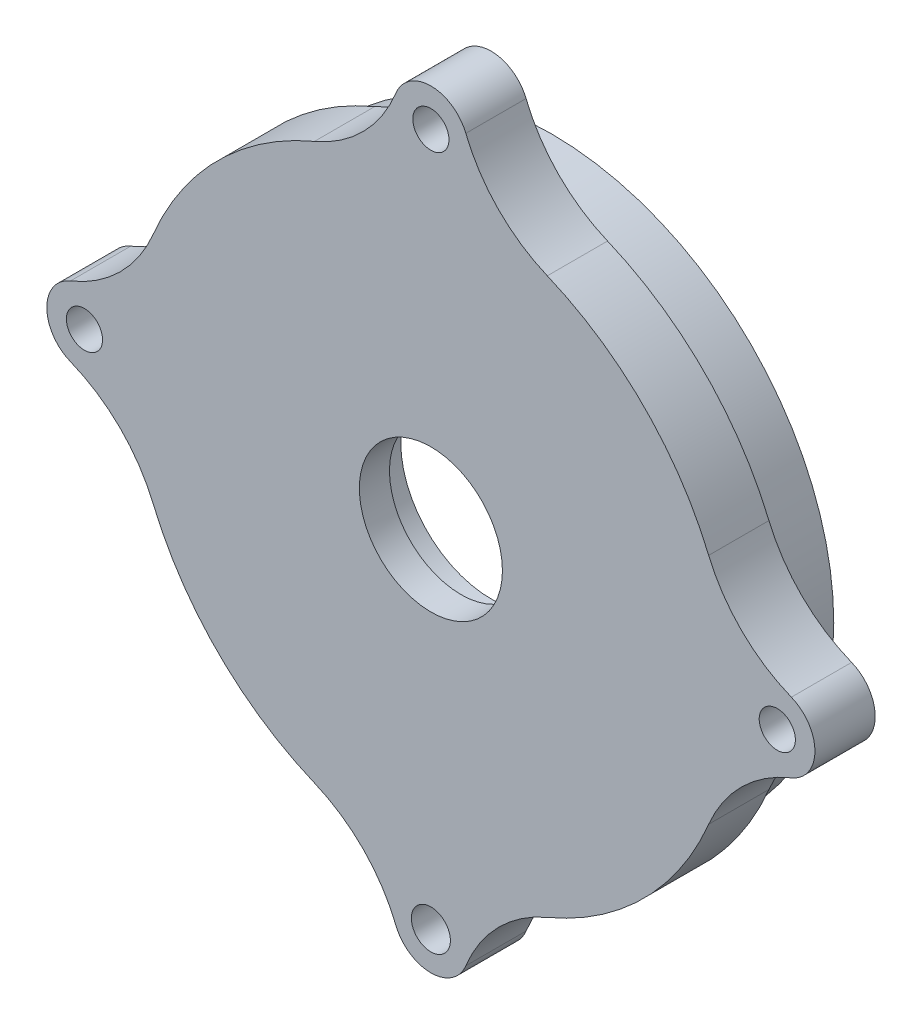
ISO-10303-21;
HEADER;
FILE_DESCRIPTION(('STEP AP214'),'2;1');
FILE_NAME('part.step','',(''),(''),'','','');
FILE_SCHEMA(('AUTOMOTIVE_DESIGN { 1 0 10303 214 1 1 1 1 }'));
ENDSEC;
DATA;
#1=APPLICATION_CONTEXT('core data for automotive mechanical design processes');
#2=APPLICATION_PROTOCOL_DEFINITION('international standard','automotive_design',2000,#1);
#3=PRODUCT_CONTEXT('',#1,'mechanical');
#4=PRODUCT('Part','Part','',(#3));
#5=PRODUCT_RELATED_PRODUCT_CATEGORY('part','',(#4));
#6=PRODUCT_DEFINITION_FORMATION('','',#4);
#7=PRODUCT_DEFINITION_CONTEXT('part definition',#1,'design');
#8=PRODUCT_DEFINITION('design','',#6,#7);
#9=PRODUCT_DEFINITION_SHAPE('','',#8);
#10=(LENGTH_UNIT() NAMED_UNIT(*) SI_UNIT(.MILLI.,.METRE.));
#11=(NAMED_UNIT(*) PLANE_ANGLE_UNIT() SI_UNIT($,.RADIAN.));
#12=(NAMED_UNIT(*) SI_UNIT($,.STERADIAN.) SOLID_ANGLE_UNIT());
#13=UNCERTAINTY_MEASURE_WITH_UNIT(LENGTH_MEASURE(1.E-05),#10,'distance_accuracy_value','');
#14=(GEOMETRIC_REPRESENTATION_CONTEXT(3) GLOBAL_UNCERTAINTY_ASSIGNED_CONTEXT((#13)) GLOBAL_UNIT_ASSIGNED_CONTEXT((#10,
#11,#12)) REPRESENTATION_CONTEXT('',''));
#15=CARTESIAN_POINT('',(0.,0.,0.));
#16=DIRECTION('',(0.,0.,1.));
#17=DIRECTION('',(1.,0.,0.));
#18=AXIS2_PLACEMENT_3D('',#15,#16,#17);
#19=CARTESIAN_POINT('',(0.,0.,4.));
#20=DIRECTION('',(0.,0.,-1.));
#21=DIRECTION('',(-1.,0.,0.));
#22=AXIS2_PLACEMENT_3D('',#19,#20,#21);
#23=CYLINDRICAL_SURFACE('',#22,20.);
#24=DIRECTION('',(0.,0.,1.));
#25=VECTOR('',#24,1.);
#26=CARTESIAN_POINT('',(-7.73032443556006,18.445652173913,0.));
#27=LINE('',#26,#25);
#28=CARTESIAN_POINT('',(-7.73032443556006,18.445652173913,0.));
#29=VERTEX_POINT('',#28);
#30=CARTESIAN_POINT('',(-7.73032443556006,18.445652173913,4.));
#31=VERTEX_POINT('',#30);
#32=EDGE_CURVE('E188',#29,#31,#27,.T.);
#33=ORIENTED_EDGE('',*,*,#32,.F.);
#34=CARTESIAN_POINT('',(0.,0.,0.));
#35=DIRECTION('',(0.,0.,1.));
#36=DIRECTION('',(1.,0.,0.));
#37=AXIS2_PLACEMENT_3D('',#34,#35,#36);
#38=CIRCLE('',#37,20.);
#39=CARTESIAN_POINT('',(-18.4456521739118,7.73032443556295,0.));
#40=VERTEX_POINT('',#39);
#41=EDGE_CURVE('E316',#29,#40,#38,.T.);
#42=ORIENTED_EDGE('',*,*,#41,.T.);
#43=DIRECTION('',(0.,0.,1.));
#44=VECTOR('',#43,1.);
#45=CARTESIAN_POINT('',(-18.4456521739118,7.73032443556295,0.));
#46=LINE('',#45,#44);
#47=CARTESIAN_POINT('',(-18.4456521739118,7.73032443556295,4.));
#48=VERTEX_POINT('',#47);
#49=EDGE_CURVE('E248',#40,#48,#46,.T.);
#50=ORIENTED_EDGE('',*,*,#49,.T.);
#51=CARTESIAN_POINT('',(0.,0.,4.));
#52=DIRECTION('',(0.,0.,1.));
#53=DIRECTION('',(1.,0.,0.));
#54=AXIS2_PLACEMENT_3D('',#51,#52,#53);
#55=CIRCLE('',#54,20.);
#56=EDGE_CURVE('E52',#31,#48,#55,.T.);
#57=ORIENTED_EDGE('',*,*,#56,.F.);
#58=EDGE_LOOP('',(#33,#42,#50,#57));
#59=FACE_BOUND('',#58,.T.);
#60=ADVANCED_FACE('F37',(#59),#23,.T.);
#61=CARTESIAN_POINT('',(18.4456521739143,7.73032443555696,0.));
#62=VERTEX_POINT('',#61);
#63=CARTESIAN_POINT('',(7.73032443556005,18.4456521739131,0.));
#64=VERTEX_POINT('',#63);
#65=EDGE_CURVE('E315',#62,#64,#38,.T.);
#66=ORIENTED_EDGE('',*,*,#65,.T.);
#67=DIRECTION('',(0.,0.,1.));
#68=VECTOR('',#67,1.);
#69=CARTESIAN_POINT('',(7.73032443556005,18.445652173913,0.));
#70=LINE('',#69,#68);
#71=CARTESIAN_POINT('',(7.73032443556005,18.4456521739131,4.));
#72=VERTEX_POINT('',#71);
#73=EDGE_CURVE('E60',#64,#72,#70,.T.);
#74=ORIENTED_EDGE('',*,*,#73,.T.);
#75=CARTESIAN_POINT('',(18.4456521739143,7.73032443555695,4.));
#76=VERTEX_POINT('',#75);
#77=EDGE_CURVE('E312',#76,#72,#55,.T.);
#78=ORIENTED_EDGE('',*,*,#77,.F.);
#79=DIRECTION('',(0.,0.,1.));
#80=VECTOR('',#79,1.);
#81=CARTESIAN_POINT('',(18.4456521739143,7.73032443555696,0.));
#82=LINE('',#81,#80);
#83=EDGE_CURVE('E218',#62,#76,#82,.T.);
#84=ORIENTED_EDGE('',*,*,#83,.F.);
#85=EDGE_LOOP('',(#66,#74,#78,#84));
#86=FACE_BOUND('',#85,.T.);
#87=ADVANCED_FACE('F359',(#86),#23,.T.);
#88=DIRECTION('',(0.,0.,1.));
#89=VECTOR('',#88,1.);
#90=CARTESIAN_POINT('',(-18.4456521739135,-7.73032443555903,0.));
#91=LINE('',#90,#89);
#92=CARTESIAN_POINT('',(-18.4456521739135,-7.73032443555903,0.));
#93=VERTEX_POINT('',#92);
#94=CARTESIAN_POINT('',(-18.4456521739135,-7.73032443555904,4.));
#95=VERTEX_POINT('',#94);
#96=EDGE_CURVE('E251',#93,#95,#91,.T.);
#97=ORIENTED_EDGE('',*,*,#96,.F.);
#98=CARTESIAN_POINT('',(-7.73032443556448,-18.4456521739112,0.));
#99=VERTEX_POINT('',#98);
#100=EDGE_CURVE('E306',#93,#99,#38,.T.);
#101=ORIENTED_EDGE('',*,*,#100,.T.);
#102=DIRECTION('',(0.,0.,1.));
#103=VECTOR('',#102,1.);
#104=CARTESIAN_POINT('',(-7.73032443556448,-18.4456521739112,0.));
#105=LINE('',#104,#103);
#106=CARTESIAN_POINT('',(-7.73032443556448,-18.4456521739112,4.));
#107=VERTEX_POINT('',#106);
#108=EDGE_CURVE('E281',#99,#107,#105,.T.);
#109=ORIENTED_EDGE('',*,*,#108,.T.);
#110=EDGE_CURVE('E313',#95,#107,#55,.T.);
#111=ORIENTED_EDGE('',*,*,#110,.F.);
#112=EDGE_LOOP('',(#97,#101,#109,#111));
#113=FACE_BOUND('',#112,.T.);
#114=ADVANCED_FACE('F338',(#113),#23,.T.);
#115=CARTESIAN_POINT('',(0.,0.,0.));
#116=DIRECTION('',(0.,0.,1.));
#117=DIRECTION('',(1.,0.,0.));
#118=AXIS2_PLACEMENT_3D('',#115,#116,#117);
#119=PLANE('',#118);
#120=CARTESIAN_POINT('',(0.,0.,0.));
#121=DIRECTION('',(0.,0.,-1.));
#122=DIRECTION('',(-1.,0.,0.));
#123=AXIS2_PLACEMENT_3D('',#120,#121,#122);
#124=CIRCLE('',#123,6.);
#125=CARTESIAN_POINT('',(-6.,0.,0.));
#126=VERTEX_POINT('',#125);
#127=EDGE_CURVE('E307',#126,#126,#124,.T.);
#128=ORIENTED_EDGE('',*,*,#127,.F.);
#129=EDGE_LOOP('',(#128));
#130=FACE_BOUND('',#129,.T.);
#131=CARTESIAN_POINT('',(0.,0.,0.));
#132=DIRECTION('',(0.,0.,-1.));
#133=DIRECTION('',(-1.,0.,0.));
#134=AXIS2_PLACEMENT_3D('',#131,#132,#133);
#135=CIRCLE('',#134,17.5);
#136=CARTESIAN_POINT('',(-17.5,0.,0.));
#137=VERTEX_POINT('',#136);
#138=EDGE_CURVE('E284',#137,#137,#135,.T.);
#139=ORIENTED_EDGE('',*,*,#138,.T.);
#140=EDGE_LOOP('',(#139));
#141=FACE_BOUND('',#140,.T.);
#142=ADVANCED_FACE('F335',(#130,#141),#119,.F.);
#143=CARTESIAN_POINT('',(7.73032443555594,-18.4456521739148,0.));
#144=VERTEX_POINT('',#143);
#145=CARTESIAN_POINT('',(18.4456521739124,-7.7303244355616,0.));
#146=VERTEX_POINT('',#145);
#147=EDGE_CURVE('E314',#144,#146,#38,.T.);
#148=ORIENTED_EDGE('',*,*,#147,.T.);
#149=DIRECTION('',(0.,0.,1.));
#150=VECTOR('',#149,1.);
#151=CARTESIAN_POINT('',(18.4456521739124,-7.7303244355616,0.));
#152=LINE('',#151,#150);
#153=CARTESIAN_POINT('',(18.4456521739124,-7.7303244355616,4.));
#154=VERTEX_POINT('',#153);
#155=EDGE_CURVE('E215',#146,#154,#152,.T.);
#156=ORIENTED_EDGE('',*,*,#155,.T.);
#157=CARTESIAN_POINT('',(7.73032443555593,-18.4456521739148,4.));
#158=VERTEX_POINT('',#157);
#159=EDGE_CURVE('E45',#158,#154,#55,.T.);
#160=ORIENTED_EDGE('',*,*,#159,.F.);
#161=DIRECTION('',(0.,0.,1.));
#162=VECTOR('',#161,1.);
#163=CARTESIAN_POINT('',(7.73032443555594,-18.4456521739148,0.));
#164=LINE('',#163,#162);
#165=EDGE_CURVE('E285',#144,#158,#164,.T.);
#166=ORIENTED_EDGE('',*,*,#165,.F.);
#167=EDGE_LOOP('',(#148,#156,#160,#166));
#168=FACE_BOUND('',#167,.T.);
#169=ADVANCED_FACE('F39',(#168),#23,.T.);
#170=CARTESIAN_POINT('',(0.,0.,4.));
#171=DIRECTION('',(0.,0.,1.));
#172=DIRECTION('',(1.,0.,0.));
#173=AXIS2_PLACEMENT_3D('',#170,#171,#172);
#174=PLANE('',#173);
#175=CARTESIAN_POINT('',(0.,0.,4.));
#176=DIRECTION('',(0.,0.,1.));
#177=DIRECTION('',(1.,0.,0.));
#178=AXIS2_PLACEMENT_3D('',#175,#176,#177);
#179=CIRCLE('',#178,4.75);
#180=CARTESIAN_POINT('',(4.75,0.,4.));
#181=VERTEX_POINT('',#180);
#182=EDGE_CURVE('E299',#181,#181,#179,.T.);
#183=ORIENTED_EDGE('',*,*,#182,.F.);
#184=EDGE_LOOP('',(#183));
#185=FACE_BOUND('',#184,.T.);
#186=ORIENTED_EDGE('',*,*,#159,.T.);
#187=CARTESIAN_POINT('',(27.6684782608686,-11.5954866533424,4.));
#188=DIRECTION('',(0.,0.,-1.));
#189=DIRECTION('',(1.,0.,0.));
#190=AXIS2_PLACEMENT_3D('',#187,#188,#189);
#191=CIRCLE('',#190,10.);
#192=CARTESIAN_POINT('',(23.9336956521718,-2.31909733067079,4.));
#193=VERTEX_POINT('',#192);
#194=EDGE_CURVE('E194',#154,#193,#191,.T.);
#195=ORIENTED_EDGE('',*,*,#194,.T.);
#196=CARTESIAN_POINT('',(22.9999999999976,-2.88657986402541E-12,4.));
#197=DIRECTION('',(0.,0.,1.));
#198=DIRECTION('',(1.,0.,0.));
#199=AXIS2_PLACEMENT_3D('',#196,#197,#198);
#200=CIRCLE('',#199,2.5);
#201=CARTESIAN_POINT('',(23.9336956521724,2.31909733066478,4.));
#202=VERTEX_POINT('',#201);
#203=EDGE_CURVE('E210',#193,#202,#200,.T.);
#204=ORIENTED_EDGE('',*,*,#203,.T.);
#205=CARTESIAN_POINT('',(27.6684782608715,11.5954866533354,4.));
#206=DIRECTION('',(0.,0.,-1.));
#207=DIRECTION('',(1.,0.,0.));
#208=AXIS2_PLACEMENT_3D('',#205,#206,#207);
#209=CIRCLE('',#208,9.99999999999999);
#210=EDGE_CURVE('E201',#202,#76,#209,.T.);
#211=ORIENTED_EDGE('',*,*,#210,.T.);
#212=ORIENTED_EDGE('',*,*,#77,.T.);
#213=CARTESIAN_POINT('',(11.5954866533401,27.6684782608696,4.));
#214=DIRECTION('',(0.,0.,-1.));
#215=DIRECTION('',(1.,0.,0.));
#216=AXIS2_PLACEMENT_3D('',#213,#214,#215);
#217=CIRCLE('',#216,10.);
#218=CARTESIAN_POINT('',(2.31909733066801,23.9336956521739,4.));
#219=VERTEX_POINT('',#218);
#220=EDGE_CURVE('E182',#72,#219,#217,.T.);
#221=ORIENTED_EDGE('',*,*,#220,.T.);
#222=CARTESIAN_POINT('',(0.,23.,4.));
#223=DIRECTION('',(0.,0.,1.));
#224=DIRECTION('',(1.,0.,0.));
#225=AXIS2_PLACEMENT_3D('',#222,#223,#224);
#226=CIRCLE('',#225,2.49999999999999);
#227=CARTESIAN_POINT('',(-2.31909733066801,23.9336956521739,4.));
#228=VERTEX_POINT('',#227);
#229=EDGE_CURVE('E156',#219,#228,#226,.T.);
#230=ORIENTED_EDGE('',*,*,#229,.T.);
#231=CARTESIAN_POINT('',(-11.5954866533401,27.6684782608696,4.));
#232=DIRECTION('',(0.,0.,-1.));
#233=DIRECTION('',(1.,0.,0.));
#234=AXIS2_PLACEMENT_3D('',#231,#232,#233);
#235=CIRCLE('',#234,10.);
#236=EDGE_CURVE('E173',#228,#31,#235,.T.);
#237=ORIENTED_EDGE('',*,*,#236,.T.);
#238=ORIENTED_EDGE('',*,*,#56,.T.);
#239=CARTESIAN_POINT('',(-27.6684782608678,11.5954866533444,4.));
#240=DIRECTION('',(0.,0.,-1.));
#241=DIRECTION('',(1.,0.,0.));
#242=AXIS2_PLACEMENT_3D('',#239,#240,#241);
#243=CIRCLE('',#242,10.);
#244=CARTESIAN_POINT('',(-23.9336956521759,2.31909733067084,4.));
#245=VERTEX_POINT('',#244);
#246=EDGE_CURVE('E227',#48,#245,#243,.T.);
#247=ORIENTED_EDGE('',*,*,#246,.T.);
#248=CARTESIAN_POINT('',(-23.0000000000029,2.43945488809238E-12,4.));
#249=DIRECTION('',(0.,0.,1.));
#250=DIRECTION('',(1.,0.,0.));
#251=AXIS2_PLACEMENT_3D('',#248,#249,#250);
#252=CIRCLE('',#251,2.5);
#253=CARTESIAN_POINT('',(-23.9336956521764,-2.31909733066576,4.));
#254=VERTEX_POINT('',#253);
#255=EDGE_CURVE('E243',#245,#254,#252,.T.);
#256=ORIENTED_EDGE('',*,*,#255,.T.);
#257=CARTESIAN_POINT('',(-27.6684782608702,-11.5954866533386,4.));
#258=DIRECTION('',(0.,0.,-1.));
#259=DIRECTION('',(1.,0.,0.));
#260=AXIS2_PLACEMENT_3D('',#257,#258,#259);
#261=CIRCLE('',#260,10.);
#262=EDGE_CURVE('E234',#254,#95,#261,.T.);
#263=ORIENTED_EDGE('',*,*,#262,.T.);
#264=ORIENTED_EDGE('',*,*,#110,.T.);
#265=CARTESIAN_POINT('',(-11.5954866533467,-27.6684782608668,4.));
#266=DIRECTION('',(0.,0.,-1.));
#267=DIRECTION('',(1.,0.,0.));
#268=AXIS2_PLACEMENT_3D('',#265,#266,#267);
#269=CIRCLE('',#268,10.);
#270=CARTESIAN_POINT('',(-2.31909733067361,-23.9336956521737,4.));
#271=VERTEX_POINT('',#270);
#272=EDGE_CURVE('E260',#107,#271,#269,.T.);
#273=ORIENTED_EDGE('',*,*,#272,.T.);
#274=CARTESIAN_POINT('',(-5.32907051820075E-12,-23.0000000000004,4.));
#275=DIRECTION('',(0.,0.,1.));
#276=DIRECTION('',(1.,0.,0.));
#277=AXIS2_PLACEMENT_3D('',#274,#275,#276);
#278=CIRCLE('',#277,2.5);
#279=CARTESIAN_POINT('',(2.31909733066252,-23.9336956521748,4.));
#280=VERTEX_POINT('',#279);
#281=EDGE_CURVE('E276',#271,#280,#278,.T.);
#282=ORIENTED_EDGE('',*,*,#281,.T.);
#283=CARTESIAN_POINT('',(11.5954866533339,-27.6684782608722,4.));
#284=DIRECTION('',(0.,0.,-1.));
#285=DIRECTION('',(1.,0.,0.));
#286=AXIS2_PLACEMENT_3D('',#283,#284,#285);
#287=CIRCLE('',#286,10.);
#288=EDGE_CURVE('E267',#280,#158,#287,.T.);
#289=ORIENTED_EDGE('',*,*,#288,.T.);
#290=EDGE_LOOP('',(#186,#195,#204,#211,#212,#221,#230,#237,#238,#247,#256,#263,#264,#273,#282,#289));
#291=FACE_BOUND('',#290,.T.);
#292=CARTESIAN_POINT('',(-5.32907051820075E-12,-23.0000000000004,4.));
#293=DIRECTION('',(0.,0.,1.));
#294=DIRECTION('',(1.,0.,0.));
#295=AXIS2_PLACEMENT_3D('',#292,#293,#294);
#296=CIRCLE('',#295,1.29492945720538);
#297=CARTESIAN_POINT('',(1.29492945720005,-23.0000000000004,4.));
#298=VERTEX_POINT('',#297);
#299=EDGE_CURVE('E250',#298,#298,#296,.T.);
#300=ORIENTED_EDGE('',*,*,#299,.F.);
#301=EDGE_LOOP('',(#300));
#302=FACE_BOUND('',#301,.T.);
#303=CARTESIAN_POINT('',(-23.0000000000029,2.43945488809238E-12,4.));
#304=DIRECTION('',(0.,0.,1.));
#305=DIRECTION('',(1.,0.,0.));
#306=AXIS2_PLACEMENT_3D('',#303,#304,#305);
#307=CIRCLE('',#306,1.20000000000157);
#308=CARTESIAN_POINT('',(-21.8000000000013,2.43945488809238E-12,4.));
#309=VERTEX_POINT('',#308);
#310=EDGE_CURVE('E217',#309,#309,#307,.T.);
#311=ORIENTED_EDGE('',*,*,#310,.F.);
#312=EDGE_LOOP('',(#311));
#313=FACE_BOUND('',#312,.T.);
#314=CARTESIAN_POINT('',(22.9999999999976,-2.88657986402541E-12,4.));
#315=DIRECTION('',(0.,0.,1.));
#316=DIRECTION('',(1.,0.,0.));
#317=AXIS2_PLACEMENT_3D('',#314,#315,#316);
#318=CIRCLE('',#317,1.2000000000037);
#319=CARTESIAN_POINT('',(24.2000000000013,-2.88657986402541E-12,4.));
#320=VERTEX_POINT('',#319);
#321=EDGE_CURVE('E187',#320,#320,#318,.T.);
#322=ORIENTED_EDGE('',*,*,#321,.F.);
#323=EDGE_LOOP('',(#322));
#324=FACE_BOUND('',#323,.T.);
#325=CARTESIAN_POINT('',(0.,23.,4.));
#326=DIRECTION('',(0.,0.,1.));
#327=DIRECTION('',(1.,0.,0.));
#328=AXIS2_PLACEMENT_3D('',#325,#326,#327);
#329=CIRCLE('',#328,1.20000000000001);
#330=CARTESIAN_POINT('',(1.20000000000001,23.,4.));
#331=VERTEX_POINT('',#330);
#332=EDGE_CURVE('E178',#331,#331,#329,.T.);
#333=ORIENTED_EDGE('',*,*,#332,.F.);
#334=EDGE_LOOP('',(#333));
#335=FACE_BOUND('',#334,.T.);
#336=ADVANCED_FACE('F364',(#185,#291,#302,#313,#324,#335),#174,.T.);
#337=CARTESIAN_POINT('',(0.,0.,0.));
#338=DIRECTION('',(0.,0.,1.));
#339=DIRECTION('',(1.,0.,0.));
#340=AXIS2_PLACEMENT_3D('',#337,#338,#339);
#341=CIRCLE('',#340,18.75);
#342=CARTESIAN_POINT('',(18.75,0.,0.));
#343=VERTEX_POINT('',#342);
#344=EDGE_CURVE('E11',#343,#343,#341,.F.);
#345=ORIENTED_EDGE('',*,*,#344,.F.);
#346=EDGE_LOOP('',(#345));
#347=FACE_BOUND('',#346,.T.);
#348=ORIENTED_EDGE('',*,*,#147,.F.);
#349=CARTESIAN_POINT('',(11.5954866533339,-27.6684782608722,0.));
#350=DIRECTION('',(0.,0.,-1.));
#351=DIRECTION('',(1.,0.,0.));
#352=AXIS2_PLACEMENT_3D('',#349,#350,#351);
#353=CIRCLE('',#352,10.);
#354=CARTESIAN_POINT('',(2.31909733066252,-23.9336956521748,0.));
#355=VERTEX_POINT('',#354);
#356=EDGE_CURVE('E270',#355,#144,#353,.T.);
#357=ORIENTED_EDGE('',*,*,#356,.F.);
#358=CARTESIAN_POINT('',(-5.32907051820075E-12,-23.0000000000004,0.));
#359=DIRECTION('',(0.,0.,1.));
#360=DIRECTION('',(1.,0.,0.));
#361=AXIS2_PLACEMENT_3D('',#358,#359,#360);
#362=CIRCLE('',#361,2.5);
#363=CARTESIAN_POINT('',(-2.31909733067361,-23.9336956521737,0.));
#364=VERTEX_POINT('',#363);
#365=EDGE_CURVE('E266',#364,#355,#362,.T.);
#366=ORIENTED_EDGE('',*,*,#365,.F.);
#367=CARTESIAN_POINT('',(-11.5954866533467,-27.6684782608668,0.));
#368=DIRECTION('',(0.,0.,-1.));
#369=DIRECTION('',(1.,0.,0.));
#370=AXIS2_PLACEMENT_3D('',#367,#368,#369);
#371=CIRCLE('',#370,10.);
#372=EDGE_CURVE('E263',#99,#364,#371,.T.);
#373=ORIENTED_EDGE('',*,*,#372,.F.);
#374=ORIENTED_EDGE('',*,*,#100,.F.);
#375=CARTESIAN_POINT('',(-27.6684782608702,-11.5954866533386,0.));
#376=DIRECTION('',(0.,0.,-1.));
#377=DIRECTION('',(1.,0.,0.));
#378=AXIS2_PLACEMENT_3D('',#375,#376,#377);
#379=CIRCLE('',#378,10.);
#380=CARTESIAN_POINT('',(-23.9336956521764,-2.31909733066576,0.));
#381=VERTEX_POINT('',#380);
#382=EDGE_CURVE('E237',#381,#93,#379,.T.);
#383=ORIENTED_EDGE('',*,*,#382,.F.);
#384=CARTESIAN_POINT('',(-23.0000000000029,2.43945488809238E-12,0.));
#385=DIRECTION('',(0.,0.,1.));
#386=DIRECTION('',(1.,0.,0.));
#387=AXIS2_PLACEMENT_3D('',#384,#385,#386);
#388=CIRCLE('',#387,2.5);
#389=CARTESIAN_POINT('',(-23.9336956521759,2.31909733067084,0.));
#390=VERTEX_POINT('',#389);
#391=EDGE_CURVE('E233',#390,#381,#388,.T.);
#392=ORIENTED_EDGE('',*,*,#391,.F.);
#393=CARTESIAN_POINT('',(-27.6684782608678,11.5954866533444,0.));
#394=DIRECTION('',(0.,0.,-1.));
#395=DIRECTION('',(1.,0.,0.));
#396=AXIS2_PLACEMENT_3D('',#393,#394,#395);
#397=CIRCLE('',#396,10.);
#398=EDGE_CURVE('E230',#40,#390,#397,.T.);
#399=ORIENTED_EDGE('',*,*,#398,.F.);
#400=ORIENTED_EDGE('',*,*,#41,.F.);
#401=CARTESIAN_POINT('',(-11.5954866533401,27.6684782608696,0.));
#402=DIRECTION('',(0.,0.,-1.));
#403=DIRECTION('',(1.,0.,0.));
#404=AXIS2_PLACEMENT_3D('',#401,#402,#403);
#405=CIRCLE('',#404,10.);
#406=CARTESIAN_POINT('',(-2.31909733066801,23.9336956521739,0.));
#407=VERTEX_POINT('',#406);
#408=EDGE_CURVE('E162',#407,#29,#405,.T.);
#409=ORIENTED_EDGE('',*,*,#408,.F.);
#410=CARTESIAN_POINT('',(0.,23.,0.));
#411=DIRECTION('',(0.,0.,1.));
#412=DIRECTION('',(1.,0.,0.));
#413=AXIS2_PLACEMENT_3D('',#410,#411,#412);
#414=CIRCLE('',#413,2.49999999999999);
#415=CARTESIAN_POINT('',(2.31909733066801,23.9336956521739,0.));
#416=VERTEX_POINT('',#415);
#417=EDGE_CURVE('E154',#416,#407,#414,.T.);
#418=ORIENTED_EDGE('',*,*,#417,.F.);
#419=CARTESIAN_POINT('',(11.5954866533401,27.6684782608696,0.));
#420=DIRECTION('',(0.,0.,-1.));
#421=DIRECTION('',(1.,0.,0.));
#422=AXIS2_PLACEMENT_3D('',#419,#420,#421);
#423=CIRCLE('',#422,10.);
#424=EDGE_CURVE('E169',#64,#416,#423,.T.);
#425=ORIENTED_EDGE('',*,*,#424,.F.);
#426=ORIENTED_EDGE('',*,*,#65,.F.);
#427=CARTESIAN_POINT('',(27.6684782608715,11.5954866533354,0.));
#428=DIRECTION('',(0.,0.,-1.));
#429=DIRECTION('',(1.,0.,0.));
#430=AXIS2_PLACEMENT_3D('',#427,#428,#429);
#431=CIRCLE('',#430,9.99999999999999);
#432=CARTESIAN_POINT('',(23.9336956521724,2.31909733066478,0.));
#433=VERTEX_POINT('',#432);
#434=EDGE_CURVE('E204',#433,#62,#431,.T.);
#435=ORIENTED_EDGE('',*,*,#434,.F.);
#436=CARTESIAN_POINT('',(22.9999999999976,-2.88657986402541E-12,0.));
#437=DIRECTION('',(0.,0.,1.));
#438=DIRECTION('',(1.,0.,0.));
#439=AXIS2_PLACEMENT_3D('',#436,#437,#438);
#440=CIRCLE('',#439,2.5);
#441=CARTESIAN_POINT('',(23.9336956521718,-2.31909733067079,0.));
#442=VERTEX_POINT('',#441);
#443=EDGE_CURVE('E200',#442,#433,#440,.T.);
#444=ORIENTED_EDGE('',*,*,#443,.F.);
#445=CARTESIAN_POINT('',(27.6684782608686,-11.5954866533424,0.));
#446=DIRECTION('',(0.,0.,-1.));
#447=DIRECTION('',(1.,0.,0.));
#448=AXIS2_PLACEMENT_3D('',#445,#446,#447);
#449=CIRCLE('',#448,10.);
#450=EDGE_CURVE('E197',#146,#442,#449,.T.);
#451=ORIENTED_EDGE('',*,*,#450,.F.);
#452=EDGE_LOOP('',(#348,#357,#366,#373,#374,#383,#392,#399,#400,#409,#418,#425,#426,#435,#444,#451));
#453=FACE_BOUND('',#452,.T.);
#454=CARTESIAN_POINT('',(-5.32907051820075E-12,-23.0000000000004,0.));
#455=DIRECTION('',(0.,0.,1.));
#456=DIRECTION('',(1.,0.,0.));
#457=AXIS2_PLACEMENT_3D('',#454,#455,#456);
#458=CIRCLE('',#457,1.29492945720538);
#459=CARTESIAN_POINT('',(1.29492945720005,-23.0000000000004,0.));
#460=VERTEX_POINT('',#459);
#461=EDGE_CURVE('E257',#460,#460,#458,.T.);
#462=ORIENTED_EDGE('',*,*,#461,.T.);
#463=EDGE_LOOP('',(#462));
#464=FACE_BOUND('',#463,.T.);
#465=CARTESIAN_POINT('',(-23.0000000000029,2.43945488809238E-12,0.));
#466=DIRECTION('',(0.,0.,1.));
#467=DIRECTION('',(1.,0.,0.));
#468=AXIS2_PLACEMENT_3D('',#465,#466,#467);
#469=CIRCLE('',#468,1.20000000000157);
#470=CARTESIAN_POINT('',(-21.8000000000013,2.43945488809238E-12,0.));
#471=VERTEX_POINT('',#470);
#472=EDGE_CURVE('E224',#471,#471,#469,.T.);
#473=ORIENTED_EDGE('',*,*,#472,.T.);
#474=EDGE_LOOP('',(#473));
#475=FACE_BOUND('',#474,.T.);
#476=CARTESIAN_POINT('',(22.9999999999976,-2.88657986402541E-12,0.));
#477=DIRECTION('',(0.,0.,1.));
#478=DIRECTION('',(1.,0.,0.));
#479=AXIS2_PLACEMENT_3D('',#476,#477,#478);
#480=CIRCLE('',#479,1.2000000000037);
#481=CARTESIAN_POINT('',(24.2000000000013,-2.88657986402541E-12,0.));
#482=VERTEX_POINT('',#481);
#483=EDGE_CURVE('E191',#482,#482,#480,.T.);
#484=ORIENTED_EDGE('',*,*,#483,.T.);
#485=EDGE_LOOP('',(#484));
#486=FACE_BOUND('',#485,.T.);
#487=CARTESIAN_POINT('',(0.,23.,0.));
#488=DIRECTION('',(0.,0.,1.));
#489=DIRECTION('',(1.,0.,0.));
#490=AXIS2_PLACEMENT_3D('',#487,#488,#489);
#491=CIRCLE('',#490,1.20000000000001);
#492=CARTESIAN_POINT('',(1.20000000000001,23.,0.));
#493=VERTEX_POINT('',#492);
#494=EDGE_CURVE('E184',#493,#493,#491,.T.);
#495=ORIENTED_EDGE('',*,*,#494,.T.);
#496=EDGE_LOOP('',(#495));
#497=FACE_BOUND('',#496,.T.);
#498=ADVANCED_FACE('F167',(#347,#453,#464,#475,#486,#497),#119,.F.);
#499=CARTESIAN_POINT('',(0.,0.,2.));
#500=DIRECTION('',(0.,0.,-1.));
#501=DIRECTION('',(-1.,0.,0.));
#502=AXIS2_PLACEMENT_3D('',#499,#500,#501);
#503=CYLINDRICAL_SURFACE('',#502,6.);
#504=CARTESIAN_POINT('',(0.,0.,2.));
#505=DIRECTION('',(0.,0.,-1.));
#506=DIRECTION('',(-1.,0.,0.));
#507=AXIS2_PLACEMENT_3D('',#504,#505,#506);
#508=CIRCLE('',#507,6.);
#509=CARTESIAN_POINT('',(-6.,0.,2.));
#510=VERTEX_POINT('',#509);
#511=EDGE_CURVE('E303',#510,#510,#508,.T.);
#512=ORIENTED_EDGE('',*,*,#511,.F.);
#513=EDGE_LOOP('',(#512));
#514=FACE_BOUND('',#513,.T.);
#515=ORIENTED_EDGE('',*,*,#127,.T.);
#516=EDGE_LOOP('',(#515));
#517=FACE_BOUND('',#516,.T.);
#518=ADVANCED_FACE('F326',(#514,#517),#503,.F.);
#519=CARTESIAN_POINT('',(0.,0.,2.));
#520=DIRECTION('',(0.,0.,-1.));
#521=DIRECTION('',(-1.,0.,0.));
#522=AXIS2_PLACEMENT_3D('',#519,#520,#521);
#523=PLANE('',#522);
#524=CARTESIAN_POINT('',(0.,0.,2.));
#525=DIRECTION('',(0.,0.,-1.));
#526=DIRECTION('',(-1.,0.,0.));
#527=AXIS2_PLACEMENT_3D('',#524,#525,#526);
#528=CIRCLE('',#527,4.75);
#529=CARTESIAN_POINT('',(-4.75,0.,2.));
#530=VERTEX_POINT('',#529);
#531=EDGE_CURVE('E302',#530,#530,#528,.T.);
#532=ORIENTED_EDGE('',*,*,#531,.F.);
#533=EDGE_LOOP('',(#532));
#534=FACE_BOUND('',#533,.T.);
#535=ORIENTED_EDGE('',*,*,#511,.T.);
#536=EDGE_LOOP('',(#535));
#537=FACE_BOUND('',#536,.T.);
#538=ADVANCED_FACE('F323',(#534,#537),#523,.T.);
#539=CARTESIAN_POINT('',(0.,0.,-18.));
#540=DIRECTION('',(0.,0.,1.));
#541=DIRECTION('',(1.,0.,0.));
#542=AXIS2_PLACEMENT_3D('',#539,#540,#541);
#543=CYLINDRICAL_SURFACE('',#542,4.75);
#544=ORIENTED_EDGE('',*,*,#531,.T.);
#545=EDGE_LOOP('',(#544));
#546=FACE_BOUND('',#545,.T.);
#547=ORIENTED_EDGE('',*,*,#182,.T.);
#548=EDGE_LOOP('',(#547));
#549=FACE_BOUND('',#548,.T.);
#550=ADVANCED_FACE('F320',(#546,#549),#543,.F.);
#551=CARTESIAN_POINT('',(0.,0.,-4.));
#552=DIRECTION('',(0.,0.,-1.));
#553=DIRECTION('',(-1.,0.,0.));
#554=AXIS2_PLACEMENT_3D('',#551,#552,#553);
#555=PLANE('',#554);
#556=CARTESIAN_POINT('',(0.,0.,-4.));
#557=DIRECTION('',(0.,0.,-1.));
#558=DIRECTION('',(-1.,0.,0.));
#559=AXIS2_PLACEMENT_3D('',#556,#557,#558);
#560=CIRCLE('',#559,18.75);
#561=CARTESIAN_POINT('',(-18.75,0.,-4.));
#562=VERTEX_POINT('',#561);
#563=EDGE_CURVE('E294',#562,#562,#560,.T.);
#564=ORIENTED_EDGE('',*,*,#563,.T.);
#565=EDGE_LOOP('',(#564));
#566=FACE_BOUND('',#565,.T.);
#567=CARTESIAN_POINT('',(0.,0.,-4.));
#568=DIRECTION('',(0.,0.,-1.));
#569=DIRECTION('',(-1.,0.,0.));
#570=AXIS2_PLACEMENT_3D('',#567,#568,#569);
#571=CIRCLE('',#570,17.5);
#572=CARTESIAN_POINT('',(-17.5,0.,-4.));
#573=VERTEX_POINT('',#572);
#574=EDGE_CURVE('E291',#573,#573,#571,.T.);
#575=ORIENTED_EDGE('',*,*,#574,.F.);
#576=EDGE_LOOP('',(#575));
#577=FACE_BOUND('',#576,.T.);
#578=ADVANCED_FACE('F354',(#566,#577),#555,.T.);
#579=CARTESIAN_POINT('',(0.,0.,-4.));
#580=DIRECTION('',(0.,0.,1.));
#581=DIRECTION('',(1.,0.,0.));
#582=AXIS2_PLACEMENT_3D('',#579,#580,#581);
#583=CYLINDRICAL_SURFACE('',#582,18.75);
#584=ORIENTED_EDGE('',*,*,#563,.F.);
#585=EDGE_LOOP('',(#584));
#586=FACE_BOUND('',#585,.T.);
#587=ORIENTED_EDGE('',*,*,#344,.T.);
#588=EDGE_LOOP('',(#587));
#589=FACE_BOUND('',#588,.T.);
#590=ADVANCED_FACE('F344',(#586,#589),#583,.T.);
#591=CARTESIAN_POINT('',(0.,0.,-4.));
#592=DIRECTION('',(0.,0.,1.));
#593=DIRECTION('',(1.,0.,0.));
#594=AXIS2_PLACEMENT_3D('',#591,#592,#593);
#595=CYLINDRICAL_SURFACE('',#594,17.5);
#596=ORIENTED_EDGE('',*,*,#574,.T.);
#597=EDGE_LOOP('',(#596));
#598=FACE_BOUND('',#597,.T.);
#599=ORIENTED_EDGE('',*,*,#138,.F.);
#600=EDGE_LOOP('',(#599));
#601=FACE_BOUND('',#600,.T.);
#602=ADVANCED_FACE('F341',(#598,#601),#595,.F.);
#603=CARTESIAN_POINT('',(-11.5954866533467,-27.6684782608668,0.));
#604=DIRECTION('',(0.,0.,1.));
#605=DIRECTION('',(1.,0.,0.));
#606=AXIS2_PLACEMENT_3D('',#603,#604,#605);
#607=CYLINDRICAL_SURFACE('',#606,10.);
#608=ORIENTED_EDGE('',*,*,#272,.F.);
#609=ORIENTED_EDGE('',*,*,#108,.F.);
#610=ORIENTED_EDGE('',*,*,#372,.T.);
#611=DIRECTION('',(0.,0.,1.));
#612=VECTOR('',#611,1.);
#613=CARTESIAN_POINT('',(-2.31909733067361,-23.9336956521737,0.));
#614=LINE('',#613,#612);
#615=EDGE_CURVE('E273',#364,#271,#614,.T.);
#616=ORIENTED_EDGE('',*,*,#615,.T.);
#617=EDGE_LOOP('',(#608,#609,#610,#616));
#618=FACE_BOUND('',#617,.T.);
#619=ADVANCED_FACE('F343',(#618),#607,.F.);
#620=CARTESIAN_POINT('',(11.5954866533339,-27.6684782608722,0.));
#621=DIRECTION('',(0.,0.,1.));
#622=DIRECTION('',(1.,0.,0.));
#623=AXIS2_PLACEMENT_3D('',#620,#621,#622);
#624=CYLINDRICAL_SURFACE('',#623,10.);
#625=ORIENTED_EDGE('',*,*,#288,.F.);
#626=DIRECTION('',(0.,0.,1.));
#627=VECTOR('',#626,1.);
#628=CARTESIAN_POINT('',(2.31909733066252,-23.9336956521748,0.));
#629=LINE('',#628,#627);
#630=EDGE_CURVE('E288',#355,#280,#629,.T.);
#631=ORIENTED_EDGE('',*,*,#630,.F.);
#632=ORIENTED_EDGE('',*,*,#356,.T.);
#633=ORIENTED_EDGE('',*,*,#165,.T.);
#634=EDGE_LOOP('',(#625,#631,#632,#633));
#635=FACE_BOUND('',#634,.T.);
#636=ADVANCED_FACE('F351',(#635),#624,.F.);
#637=CARTESIAN_POINT('',(-5.32907051820075E-12,-23.0000000000004,0.));
#638=DIRECTION('',(0.,0.,1.));
#639=DIRECTION('',(1.,0.,0.));
#640=AXIS2_PLACEMENT_3D('',#637,#638,#639);
#641=CYLINDRICAL_SURFACE('',#640,2.5);
#642=ORIENTED_EDGE('',*,*,#281,.F.);
#643=ORIENTED_EDGE('',*,*,#615,.F.);
#644=ORIENTED_EDGE('',*,*,#365,.T.);
#645=ORIENTED_EDGE('',*,*,#630,.T.);
#646=EDGE_LOOP('',(#642,#643,#644,#645));
#647=FACE_BOUND('',#646,.T.);
#648=ADVANCED_FACE('F402',(#647),#641,.T.);
#649=CARTESIAN_POINT('',(-5.32907051820075E-12,-23.0000000000004,0.));
#650=DIRECTION('',(0.,0.,1.));
#651=DIRECTION('',(1.,0.,0.));
#652=AXIS2_PLACEMENT_3D('',#649,#650,#651);
#653=CYLINDRICAL_SURFACE('',#652,1.29492945720538);
#654=ORIENTED_EDGE('',*,*,#461,.F.);
#655=EDGE_LOOP('',(#654));
#656=FACE_BOUND('',#655,.T.);
#657=ORIENTED_EDGE('',*,*,#299,.T.);
#658=EDGE_LOOP('',(#657));
#659=FACE_BOUND('',#658,.T.);
#660=ADVANCED_FACE('F441',(#656,#659),#653,.F.);
#661=CARTESIAN_POINT('',(-27.6684782608678,11.5954866533444,0.));
#662=DIRECTION('',(0.,0.,1.));
#663=DIRECTION('',(1.,0.,0.));
#664=AXIS2_PLACEMENT_3D('',#661,#662,#663);
#665=CYLINDRICAL_SURFACE('',#664,10.);
#666=ORIENTED_EDGE('',*,*,#246,.F.);
#667=ORIENTED_EDGE('',*,*,#49,.F.);
#668=ORIENTED_EDGE('',*,*,#398,.T.);
#669=DIRECTION('',(0.,0.,1.));
#670=VECTOR('',#669,1.);
#671=CARTESIAN_POINT('',(-23.9336956521759,2.31909733067084,0.));
#672=LINE('',#671,#670);
#673=EDGE_CURVE('E240',#390,#245,#672,.T.);
#674=ORIENTED_EDGE('',*,*,#673,.T.);
#675=EDGE_LOOP('',(#666,#667,#668,#674));
#676=FACE_BOUND('',#675,.T.);
#677=ADVANCED_FACE('F389',(#676),#665,.F.);
#678=CARTESIAN_POINT('',(-27.6684782608702,-11.5954866533386,0.));
#679=DIRECTION('',(0.,0.,1.));
#680=DIRECTION('',(1.,0.,0.));
#681=AXIS2_PLACEMENT_3D('',#678,#679,#680);
#682=CYLINDRICAL_SURFACE('',#681,10.);
#683=ORIENTED_EDGE('',*,*,#262,.F.);
#684=DIRECTION('',(0.,0.,1.));
#685=VECTOR('',#684,1.);
#686=CARTESIAN_POINT('',(-23.9336956521764,-2.31909733066576,0.));
#687=LINE('',#686,#685);
#688=EDGE_CURVE('E254',#381,#254,#687,.T.);
#689=ORIENTED_EDGE('',*,*,#688,.F.);
#690=ORIENTED_EDGE('',*,*,#382,.T.);
#691=ORIENTED_EDGE('',*,*,#96,.T.);
#692=EDGE_LOOP('',(#683,#689,#690,#691));
#693=FACE_BOUND('',#692,.T.);
#694=ADVANCED_FACE('F380',(#693),#682,.F.);
#695=CARTESIAN_POINT('',(-23.0000000000029,2.43945488809238E-12,0.));
#696=DIRECTION('',(0.,0.,1.));
#697=DIRECTION('',(1.,0.,0.));
#698=AXIS2_PLACEMENT_3D('',#695,#696,#697);
#699=CYLINDRICAL_SURFACE('',#698,2.5);
#700=ORIENTED_EDGE('',*,*,#255,.F.);
#701=ORIENTED_EDGE('',*,*,#673,.F.);
#702=ORIENTED_EDGE('',*,*,#391,.T.);
#703=ORIENTED_EDGE('',*,*,#688,.T.);
#704=EDGE_LOOP('',(#700,#701,#702,#703));
#705=FACE_BOUND('',#704,.T.);
#706=ADVANCED_FACE('F386',(#705),#699,.T.);
#707=CARTESIAN_POINT('',(-23.0000000000029,2.43945488809238E-12,0.));
#708=DIRECTION('',(0.,0.,1.));
#709=DIRECTION('',(1.,0.,0.));
#710=AXIS2_PLACEMENT_3D('',#707,#708,#709);
#711=CYLINDRICAL_SURFACE('',#710,1.20000000000157);
#712=ORIENTED_EDGE('',*,*,#472,.F.);
#713=EDGE_LOOP('',(#712));
#714=FACE_BOUND('',#713,.T.);
#715=ORIENTED_EDGE('',*,*,#310,.T.);
#716=EDGE_LOOP('',(#715));
#717=FACE_BOUND('',#716,.T.);
#718=ADVANCED_FACE('F427',(#714,#717),#711,.F.);
#719=CARTESIAN_POINT('',(27.6684782608686,-11.5954866533424,0.));
#720=DIRECTION('',(0.,0.,1.));
#721=DIRECTION('',(1.,0.,0.));
#722=AXIS2_PLACEMENT_3D('',#719,#720,#721);
#723=CYLINDRICAL_SURFACE('',#722,10.);
#724=ORIENTED_EDGE('',*,*,#194,.F.);
#725=ORIENTED_EDGE('',*,*,#155,.F.);
#726=ORIENTED_EDGE('',*,*,#450,.T.);
#727=DIRECTION('',(0.,0.,1.));
#728=VECTOR('',#727,1.);
#729=CARTESIAN_POINT('',(23.9336956521718,-2.31909733067079,0.));
#730=LINE('',#729,#728);
#731=EDGE_CURVE('E207',#442,#193,#730,.T.);
#732=ORIENTED_EDGE('',*,*,#731,.T.);
#733=EDGE_LOOP('',(#724,#725,#726,#732));
#734=FACE_BOUND('',#733,.T.);
#735=ADVANCED_FACE('F411',(#734),#723,.F.);
#736=CARTESIAN_POINT('',(27.6684782608715,11.5954866533354,0.));
#737=DIRECTION('',(0.,0.,1.));
#738=DIRECTION('',(1.,0.,0.));
#739=AXIS2_PLACEMENT_3D('',#736,#737,#738);
#740=CYLINDRICAL_SURFACE('',#739,9.99999999999999);
#741=ORIENTED_EDGE('',*,*,#210,.F.);
#742=DIRECTION('',(0.,0.,1.));
#743=VECTOR('',#742,1.);
#744=CARTESIAN_POINT('',(23.9336956521724,2.31909733066478,0.));
#745=LINE('',#744,#743);
#746=EDGE_CURVE('E221',#433,#202,#745,.T.);
#747=ORIENTED_EDGE('',*,*,#746,.F.);
#748=ORIENTED_EDGE('',*,*,#434,.T.);
#749=ORIENTED_EDGE('',*,*,#83,.T.);
#750=EDGE_LOOP('',(#741,#747,#748,#749));
#751=FACE_BOUND('',#750,.T.);
#752=ADVANCED_FACE('F418',(#751),#740,.F.);
#753=CARTESIAN_POINT('',(22.9999999999976,-2.88657986402541E-12,0.));
#754=DIRECTION('',(0.,0.,1.));
#755=DIRECTION('',(1.,0.,0.));
#756=AXIS2_PLACEMENT_3D('',#753,#754,#755);
#757=CYLINDRICAL_SURFACE('',#756,2.5);
#758=ORIENTED_EDGE('',*,*,#203,.F.);
#759=ORIENTED_EDGE('',*,*,#731,.F.);
#760=ORIENTED_EDGE('',*,*,#443,.T.);
#761=ORIENTED_EDGE('',*,*,#746,.T.);
#762=EDGE_LOOP('',(#758,#759,#760,#761));
#763=FACE_BOUND('',#762,.T.);
#764=ADVANCED_FACE('F416',(#763),#757,.T.);
#765=CARTESIAN_POINT('',(22.9999999999976,-2.88657986402541E-12,0.));
#766=DIRECTION('',(0.,0.,1.));
#767=DIRECTION('',(1.,0.,0.));
#768=AXIS2_PLACEMENT_3D('',#765,#766,#767);
#769=CYLINDRICAL_SURFACE('',#768,1.2000000000037);
#770=ORIENTED_EDGE('',*,*,#483,.F.);
#771=EDGE_LOOP('',(#770));
#772=FACE_BOUND('',#771,.T.);
#773=ORIENTED_EDGE('',*,*,#321,.T.);
#774=EDGE_LOOP('',(#773));
#775=FACE_BOUND('',#774,.T.);
#776=ADVANCED_FACE('F425',(#772,#775),#769,.F.);
#777=CARTESIAN_POINT('',(11.5954866533401,27.6684782608696,0.));
#778=DIRECTION('',(0.,0.,1.));
#779=DIRECTION('',(1.,0.,0.));
#780=AXIS2_PLACEMENT_3D('',#777,#778,#779);
#781=CYLINDRICAL_SURFACE('',#780,10.);
#782=ORIENTED_EDGE('',*,*,#220,.F.);
#783=ORIENTED_EDGE('',*,*,#73,.F.);
#784=ORIENTED_EDGE('',*,*,#424,.T.);
#785=DIRECTION('',(0.,0.,1.));
#786=VECTOR('',#785,1.);
#787=CARTESIAN_POINT('',(2.31909733066801,23.9336956521739,0.));
#788=LINE('',#787,#786);
#789=EDGE_CURVE('E151',#416,#219,#788,.T.);
#790=ORIENTED_EDGE('',*,*,#789,.T.);
#791=EDGE_LOOP('',(#782,#783,#784,#790));
#792=FACE_BOUND('',#791,.T.);
#793=ADVANCED_FACE('F172',(#792),#781,.F.);
#794=CARTESIAN_POINT('',(-11.5954866533401,27.6684782608696,0.));
#795=DIRECTION('',(0.,0.,1.));
#796=DIRECTION('',(1.,0.,0.));
#797=AXIS2_PLACEMENT_3D('',#794,#795,#796);
#798=CYLINDRICAL_SURFACE('',#797,10.);
#799=ORIENTED_EDGE('',*,*,#236,.F.);
#800=DIRECTION('',(0.,0.,1.));
#801=VECTOR('',#800,1.);
#802=CARTESIAN_POINT('',(-2.31909733066801,23.9336956521739,0.));
#803=LINE('',#802,#801);
#804=EDGE_CURVE('E161',#407,#228,#803,.T.);
#805=ORIENTED_EDGE('',*,*,#804,.F.);
#806=ORIENTED_EDGE('',*,*,#408,.T.);
#807=ORIENTED_EDGE('',*,*,#32,.T.);
#808=EDGE_LOOP('',(#799,#805,#806,#807));
#809=FACE_BOUND('',#808,.T.);
#810=ADVANCED_FACE('F393',(#809),#798,.F.);
#811=CARTESIAN_POINT('',(0.,23.,0.));
#812=DIRECTION('',(0.,0.,1.));
#813=DIRECTION('',(1.,0.,0.));
#814=AXIS2_PLACEMENT_3D('',#811,#812,#813);
#815=CYLINDRICAL_SURFACE('',#814,2.49999999999999);
#816=ORIENTED_EDGE('',*,*,#229,.F.);
#817=ORIENTED_EDGE('',*,*,#789,.F.);
#818=ORIENTED_EDGE('',*,*,#417,.T.);
#819=ORIENTED_EDGE('',*,*,#804,.T.);
#820=EDGE_LOOP('',(#816,#817,#818,#819));
#821=FACE_BOUND('',#820,.T.);
#822=ADVANCED_FACE('F153',(#821),#815,.T.);
#823=CARTESIAN_POINT('',(0.,23.,0.));
#824=DIRECTION('',(0.,0.,1.));
#825=DIRECTION('',(1.,0.,0.));
#826=AXIS2_PLACEMENT_3D('',#823,#824,#825);
#827=CYLINDRICAL_SURFACE('',#826,1.20000000000001);
#828=ORIENTED_EDGE('',*,*,#494,.F.);
#829=EDGE_LOOP('',(#828));
#830=FACE_BOUND('',#829,.T.);
#831=ORIENTED_EDGE('',*,*,#332,.T.);
#832=EDGE_LOOP('',(#831));
#833=FACE_BOUND('',#832,.T.);
#834=ADVANCED_FACE('F518',(#830,#833),#827,.F.);
#835=CLOSED_SHELL('',(#60,#87,#114,#142,#169,#336,#498,#518,#538,#550,#578,#590,#602,#619,#636,
#648,#660,#677,#694,#706,#718,#735,#752,#764,#776,#793,#810,#822,#834));
#836=MANIFOLD_SOLID_BREP('B2',#835);
#837=ADVANCED_BREP_SHAPE_REPRESENTATION('',(#18,#836),#14);
#838=SHAPE_DEFINITION_REPRESENTATION(#9,#837);
ENDSEC;
END-ISO-10303-21;
